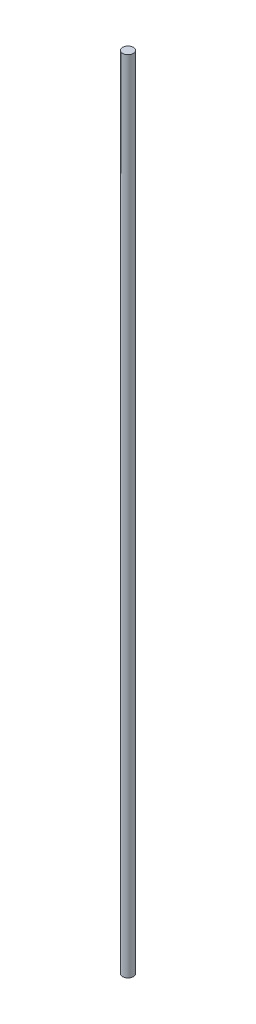
ISO-10303-21;
HEADER;
FILE_DESCRIPTION(('STEP AP214'),'2;1');
FILE_NAME('part.step','',(''),(''),'','','');
FILE_SCHEMA(('AUTOMOTIVE_DESIGN { 1 0 10303 214 1 1 1 1 }'));
ENDSEC;
DATA;
#1=APPLICATION_CONTEXT('core data for automotive mechanical design processes');
#2=APPLICATION_PROTOCOL_DEFINITION('international standard','automotive_design',2000,#1);
#3=PRODUCT_CONTEXT('',#1,'mechanical');
#4=PRODUCT('Part','Part','',(#3));
#5=PRODUCT_RELATED_PRODUCT_CATEGORY('part','',(#4));
#6=PRODUCT_DEFINITION_FORMATION('','',#4);
#7=PRODUCT_DEFINITION_CONTEXT('part definition',#1,'design');
#8=PRODUCT_DEFINITION('design','',#6,#7);
#9=PRODUCT_DEFINITION_SHAPE('','',#8);
#10=(LENGTH_UNIT() NAMED_UNIT(*) SI_UNIT(.MILLI.,.METRE.));
#11=(NAMED_UNIT(*) PLANE_ANGLE_UNIT() SI_UNIT($,.RADIAN.));
#12=(NAMED_UNIT(*) SI_UNIT($,.STERADIAN.) SOLID_ANGLE_UNIT());
#13=UNCERTAINTY_MEASURE_WITH_UNIT(LENGTH_MEASURE(1.E-05),#10,'distance_accuracy_value','');
#14=(GEOMETRIC_REPRESENTATION_CONTEXT(3) GLOBAL_UNCERTAINTY_ASSIGNED_CONTEXT((#13)) GLOBAL_UNIT_ASSIGNED_CONTEXT((#10,
#11,#12)) REPRESENTATION_CONTEXT('',''));
#15=CARTESIAN_POINT('',(0.,0.,0.));
#16=DIRECTION('',(0.,0.,1.));
#17=DIRECTION('',(1.,0.,0.));
#18=AXIS2_PLACEMENT_3D('',#15,#16,#17);
#19=CARTESIAN_POINT('',(0.,600.,0.));
#20=DIRECTION('',(0.,-1.,0.));
#21=DIRECTION('',(0.,0.,-1.));
#22=AXIS2_PLACEMENT_3D('',#19,#20,#21);
#23=CYLINDRICAL_SURFACE('',#22,4.);
#24=CARTESIAN_POINT('',(0.,600.,0.));
#25=DIRECTION('',(0.,1.,0.));
#26=DIRECTION('',(0.,0.,1.));
#27=AXIS2_PLACEMENT_3D('',#24,#25,#26);
#28=CIRCLE('',#27,4.);
#29=CARTESIAN_POINT('',(0.,600.,4.));
#30=VERTEX_POINT('',#29);
#31=EDGE_CURVE('E10',#30,#30,#28,.T.);
#32=ORIENTED_EDGE('',*,*,#31,.F.);
#33=EDGE_LOOP('',(#32));
#34=FACE_BOUND('',#33,.T.);
#35=CARTESIAN_POINT('',(0.,0.,0.));
#36=DIRECTION('',(0.,1.,0.));
#37=DIRECTION('',(0.,0.,1.));
#38=AXIS2_PLACEMENT_3D('',#35,#36,#37);
#39=CIRCLE('',#38,4.);
#40=CARTESIAN_POINT('',(0.,0.,4.));
#41=VERTEX_POINT('',#40);
#42=EDGE_CURVE('E34',#41,#41,#39,.T.);
#43=ORIENTED_EDGE('',*,*,#42,.T.);
#44=EDGE_LOOP('',(#43));
#45=FACE_BOUND('',#44,.T.);
#46=ADVANCED_FACE('F31',(#34,#45),#23,.T.);
#47=CARTESIAN_POINT('',(0.,600.,0.));
#48=DIRECTION('',(0.,1.,0.));
#49=DIRECTION('',(0.,0.,1.));
#50=AXIS2_PLACEMENT_3D('',#47,#48,#49);
#51=PLANE('',#50);
#52=ORIENTED_EDGE('',*,*,#31,.T.);
#53=EDGE_LOOP('',(#52));
#54=FACE_BOUND('',#53,.T.);
#55=ADVANCED_FACE('F46',(#54),#51,.T.);
#56=CARTESIAN_POINT('',(0.,0.,0.));
#57=DIRECTION('',(0.,1.,0.));
#58=DIRECTION('',(0.,0.,1.));
#59=AXIS2_PLACEMENT_3D('',#56,#57,#58);
#60=PLANE('',#59);
#61=ORIENTED_EDGE('',*,*,#42,.F.);
#62=EDGE_LOOP('',(#61));
#63=FACE_BOUND('',#62,.T.);
#64=ADVANCED_FACE('F44',(#63),#60,.F.);
#65=CLOSED_SHELL('',(#46,#55,#64));
#66=MANIFOLD_SOLID_BREP('B2',#65);
#67=ADVANCED_BREP_SHAPE_REPRESENTATION('',(#18,#66),#14);
#68=SHAPE_DEFINITION_REPRESENTATION(#9,#67);
ENDSEC;
END-ISO-10303-21;
